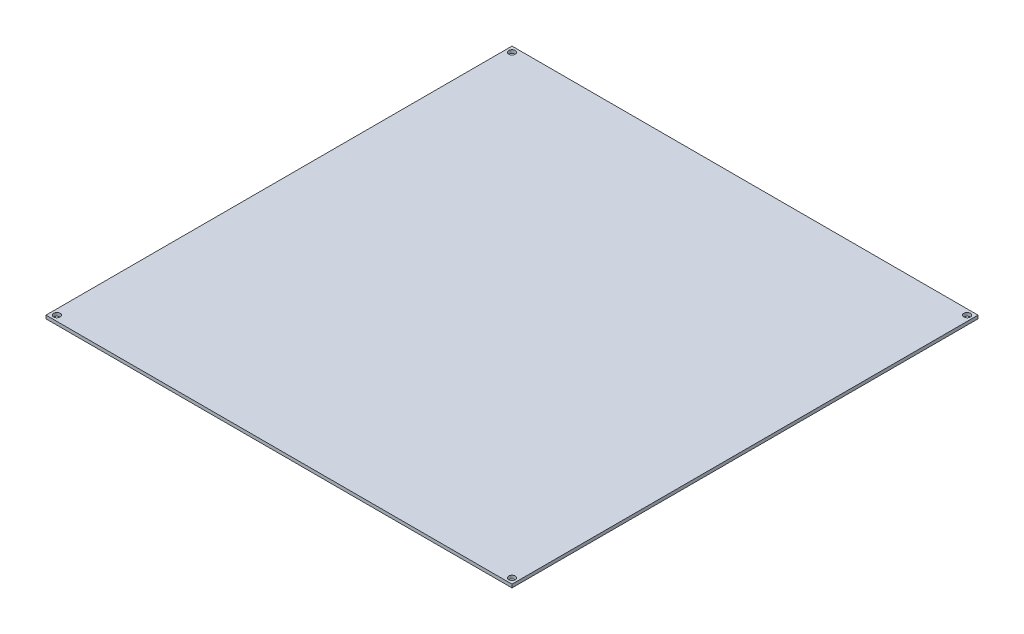
ISO-10303-21;
HEADER;
FILE_DESCRIPTION(('STEP AP214'),'2;1');
FILE_NAME('part.step','',(''),(''),'','','');
FILE_SCHEMA(('AUTOMOTIVE_DESIGN { 1 0 10303 214 1 1 1 1 }'));
ENDSEC;
DATA;
#1=APPLICATION_CONTEXT('core data for automotive mechanical design processes');
#2=APPLICATION_PROTOCOL_DEFINITION('international standard','automotive_design',2000,#1);
#3=PRODUCT_CONTEXT('',#1,'mechanical');
#4=PRODUCT('Part','Part','',(#3));
#5=PRODUCT_RELATED_PRODUCT_CATEGORY('part','',(#4));
#6=PRODUCT_DEFINITION_FORMATION('','',#4);
#7=PRODUCT_DEFINITION_CONTEXT('part definition',#1,'design');
#8=PRODUCT_DEFINITION('design','',#6,#7);
#9=PRODUCT_DEFINITION_SHAPE('','',#8);
#10=(LENGTH_UNIT() NAMED_UNIT(*) SI_UNIT(.MILLI.,.METRE.));
#11=(NAMED_UNIT(*) PLANE_ANGLE_UNIT() SI_UNIT($,.RADIAN.));
#12=(NAMED_UNIT(*) SI_UNIT($,.STERADIAN.) SOLID_ANGLE_UNIT());
#13=UNCERTAINTY_MEASURE_WITH_UNIT(LENGTH_MEASURE(1.E-05),#10,'distance_accuracy_value','');
#14=(GEOMETRIC_REPRESENTATION_CONTEXT(3) GLOBAL_UNCERTAINTY_ASSIGNED_CONTEXT((#13)) GLOBAL_UNIT_ASSIGNED_CONTEXT((#10,
#11,#12)) REPRESENTATION_CONTEXT('',''));
#15=CARTESIAN_POINT('',(0.,0.,0.));
#16=DIRECTION('',(0.,0.,1.));
#17=DIRECTION('',(1.,0.,0.));
#18=AXIS2_PLACEMENT_3D('',#15,#16,#17);
#19=CARTESIAN_POINT('',(-109.135097505646,1.5,-78.632939541794));
#20=DIRECTION('',(1.,0.,0.));
#21=DIRECTION('',(0.,0.,-1.));
#22=AXIS2_PLACEMENT_3D('',#19,#20,#21);
#23=PLANE('',#22);
#24=DIRECTION('',(0.,0.,1.));
#25=VECTOR('',#24,1.);
#26=CARTESIAN_POINT('',(-109.135097505646,0.,-78.632939541794));
#27=LINE('',#26,#25);
#28=CARTESIAN_POINT('',(-109.135097505646,0.,-78.632939541794));
#29=VERTEX_POINT('',#28);
#30=CARTESIAN_POINT('',(-109.135097505646,0.,135.367060458206));
#31=VERTEX_POINT('',#30);
#32=EDGE_CURVE('E106',#29,#31,#27,.T.);
#33=ORIENTED_EDGE('',*,*,#32,.T.);
#34=DIRECTION('',(0.,-1.,0.));
#35=VECTOR('',#34,1.);
#36=CARTESIAN_POINT('',(-109.135097505646,1.5,135.367060458206));
#37=LINE('',#36,#35);
#38=CARTESIAN_POINT('',(-109.135097505646,1.5,135.367060458206));
#39=VERTEX_POINT('',#38);
#40=EDGE_CURVE('E11',#39,#31,#37,.T.);
#41=ORIENTED_EDGE('',*,*,#40,.F.);
#42=DIRECTION('',(0.,0.,1.));
#43=VECTOR('',#42,1.);
#44=CARTESIAN_POINT('',(-109.135097505646,1.5,-78.632939541794));
#45=LINE('',#44,#43);
#46=CARTESIAN_POINT('',(-109.135097505646,1.5,-78.632939541794));
#47=VERTEX_POINT('',#46);
#48=EDGE_CURVE('E92',#47,#39,#45,.T.);
#49=ORIENTED_EDGE('',*,*,#48,.F.);
#50=DIRECTION('',(0.,-1.,0.));
#51=VECTOR('',#50,1.);
#52=CARTESIAN_POINT('',(-109.135097505646,1.5,-78.632939541794));
#53=LINE('',#52,#51);
#54=EDGE_CURVE('E102',#47,#29,#53,.T.);
#55=ORIENTED_EDGE('',*,*,#54,.T.);
#56=EDGE_LOOP('',(#33,#41,#49,#55));
#57=FACE_BOUND('',#56,.T.);
#58=ADVANCED_FACE('F39',(#57),#23,.F.);
#59=CARTESIAN_POINT('',(-109.135097505646,1.5,135.367060458206));
#60=DIRECTION('',(0.,0.,-1.));
#61=DIRECTION('',(-1.,0.,0.));
#62=AXIS2_PLACEMENT_3D('',#59,#60,#61);
#63=PLANE('',#62);
#64=DIRECTION('',(1.,0.,0.));
#65=VECTOR('',#64,1.);
#66=CARTESIAN_POINT('',(-109.135097505646,0.,135.367060458206));
#67=LINE('',#66,#65);
#68=CARTESIAN_POINT('',(104.864902494354,0.,135.367060458206));
#69=VERTEX_POINT('',#68);
#70=EDGE_CURVE('E97',#31,#69,#67,.T.);
#71=ORIENTED_EDGE('',*,*,#70,.T.);
#72=DIRECTION('',(0.,-1.,0.));
#73=VECTOR('',#72,1.);
#74=CARTESIAN_POINT('',(104.864902494354,1.5,135.367060458206));
#75=LINE('',#74,#73);
#76=CARTESIAN_POINT('',(104.864902494354,1.5,135.367060458206));
#77=VERTEX_POINT('',#76);
#78=EDGE_CURVE('E47',#77,#69,#75,.T.);
#79=ORIENTED_EDGE('',*,*,#78,.F.);
#80=DIRECTION('',(1.,0.,0.));
#81=VECTOR('',#80,1.);
#82=CARTESIAN_POINT('',(-109.135097505646,1.5,135.367060458206));
#83=LINE('',#82,#81);
#84=EDGE_CURVE('E87',#39,#77,#83,.T.);
#85=ORIENTED_EDGE('',*,*,#84,.F.);
#86=ORIENTED_EDGE('',*,*,#40,.T.);
#87=EDGE_LOOP('',(#71,#79,#85,#86));
#88=FACE_BOUND('',#87,.T.);
#89=ADVANCED_FACE('F96',(#88),#63,.F.);
#90=CARTESIAN_POINT('',(104.864902494354,1.5,-78.632939541794));
#91=DIRECTION('',(-1.,0.,0.));
#92=DIRECTION('',(0.,0.,1.));
#93=AXIS2_PLACEMENT_3D('',#90,#91,#92);
#94=PLANE('',#93);
#95=DIRECTION('',(0.,0.,-1.));
#96=VECTOR('',#95,1.);
#97=CARTESIAN_POINT('',(104.864902494354,0.,-78.632939541794));
#98=LINE('',#97,#96);
#99=CARTESIAN_POINT('',(104.864902494354,0.,-78.632939541794));
#100=VERTEX_POINT('',#99);
#101=EDGE_CURVE('E74',#69,#100,#98,.T.);
#102=ORIENTED_EDGE('',*,*,#101,.T.);
#103=DIRECTION('',(0.,-1.,0.));
#104=VECTOR('',#103,1.);
#105=CARTESIAN_POINT('',(104.864902494354,1.5,-78.632939541794));
#106=LINE('',#105,#104);
#107=CARTESIAN_POINT('',(104.864902494354,1.5,-78.632939541794));
#108=VERTEX_POINT('',#107);
#109=EDGE_CURVE('E98',#108,#100,#106,.T.);
#110=ORIENTED_EDGE('',*,*,#109,.F.);
#111=DIRECTION('',(0.,0.,-1.));
#112=VECTOR('',#111,1.);
#113=CARTESIAN_POINT('',(104.864902494354,1.5,-78.632939541794));
#114=LINE('',#113,#112);
#115=EDGE_CURVE('E90',#77,#108,#114,.T.);
#116=ORIENTED_EDGE('',*,*,#115,.F.);
#117=ORIENTED_EDGE('',*,*,#78,.T.);
#118=EDGE_LOOP('',(#102,#110,#116,#117));
#119=FACE_BOUND('',#118,.T.);
#120=ADVANCED_FACE('F99',(#119),#94,.F.);
#121=CARTESIAN_POINT('',(-109.135097505646,1.5,-78.632939541794));
#122=DIRECTION('',(0.,0.,1.));
#123=DIRECTION('',(1.,0.,0.));
#124=AXIS2_PLACEMENT_3D('',#121,#122,#123);
#125=PLANE('',#124);
#126=DIRECTION('',(-1.,0.,0.));
#127=VECTOR('',#126,1.);
#128=CARTESIAN_POINT('',(-109.135097505646,0.,-78.632939541794));
#129=LINE('',#128,#127);
#130=EDGE_CURVE('E80',#100,#29,#129,.T.);
#131=ORIENTED_EDGE('',*,*,#130,.T.);
#132=ORIENTED_EDGE('',*,*,#54,.F.);
#133=DIRECTION('',(-1.,0.,0.));
#134=VECTOR('',#133,1.);
#135=CARTESIAN_POINT('',(-109.135097505646,1.5,-78.632939541794));
#136=LINE('',#135,#134);
#137=EDGE_CURVE('E57',#108,#47,#136,.T.);
#138=ORIENTED_EDGE('',*,*,#137,.F.);
#139=ORIENTED_EDGE('',*,*,#109,.T.);
#140=EDGE_LOOP('',(#131,#132,#138,#139));
#141=FACE_BOUND('',#140,.T.);
#142=ADVANCED_FACE('F118',(#141),#125,.F.);
#143=CARTESIAN_POINT('',(0.,1.5,0.));
#144=DIRECTION('',(0.,1.,0.));
#145=DIRECTION('',(0.,0.,1.));
#146=AXIS2_PLACEMENT_3D('',#143,#144,#145);
#147=PLANE('',#146);
#148=CARTESIAN_POINT('',(-106.635097505646,1.5,132.867060458206));
#149=DIRECTION('',(0.,1.,0.));
#150=DIRECTION('',(0.,0.,1.));
#151=AXIS2_PLACEMENT_3D('',#148,#149,#150);
#152=CIRCLE('',#151,1.49999999999999);
#153=CARTESIAN_POINT('',(-106.635097505646,1.5,134.367060458206));
#154=VERTEX_POINT('',#153);
#155=EDGE_CURVE('E147',#154,#154,#152,.T.);
#156=ORIENTED_EDGE('',*,*,#155,.F.);
#157=EDGE_LOOP('',(#156));
#158=FACE_BOUND('',#157,.T.);
#159=CARTESIAN_POINT('',(-106.635097505646,1.5,-76.132939541794));
#160=DIRECTION('',(0.,1.,0.));
#161=DIRECTION('',(0.,0.,1.));
#162=AXIS2_PLACEMENT_3D('',#159,#160,#161);
#163=CIRCLE('',#162,1.49999999999999);
#164=CARTESIAN_POINT('',(-106.635097505646,1.5,-74.632939541794));
#165=VERTEX_POINT('',#164);
#166=EDGE_CURVE('E140',#165,#165,#163,.T.);
#167=ORIENTED_EDGE('',*,*,#166,.F.);
#168=EDGE_LOOP('',(#167));
#169=FACE_BOUND('',#168,.T.);
#170=CARTESIAN_POINT('',(102.364902494354,1.5,-76.132939541794));
#171=DIRECTION('',(0.,1.,0.));
#172=DIRECTION('',(0.,0.,1.));
#173=AXIS2_PLACEMENT_3D('',#170,#171,#172);
#174=CIRCLE('',#173,1.49999999999999);
#175=CARTESIAN_POINT('',(102.364902494354,1.5,-74.632939541794));
#176=VERTEX_POINT('',#175);
#177=EDGE_CURVE('E133',#176,#176,#174,.T.);
#178=ORIENTED_EDGE('',*,*,#177,.F.);
#179=EDGE_LOOP('',(#178));
#180=FACE_BOUND('',#179,.T.);
#181=CARTESIAN_POINT('',(102.364902494354,1.5,132.867060458206));
#182=DIRECTION('',(0.,1.,0.));
#183=DIRECTION('',(0.,0.,1.));
#184=AXIS2_PLACEMENT_3D('',#181,#182,#183);
#185=CIRCLE('',#184,1.49999999999999);
#186=CARTESIAN_POINT('',(102.364902494354,1.5,134.367060458206));
#187=VERTEX_POINT('',#186);
#188=EDGE_CURVE('E127',#187,#187,#185,.T.);
#189=ORIENTED_EDGE('',*,*,#188,.F.);
#190=EDGE_LOOP('',(#189));
#191=FACE_BOUND('',#190,.T.);
#192=ORIENTED_EDGE('',*,*,#48,.T.);
#193=ORIENTED_EDGE('',*,*,#84,.T.);
#194=ORIENTED_EDGE('',*,*,#115,.T.);
#195=ORIENTED_EDGE('',*,*,#137,.T.);
#196=EDGE_LOOP('',(#192,#193,#194,#195));
#197=FACE_BOUND('',#196,.T.);
#198=ADVANCED_FACE('F88',(#158,#169,#180,#191,#197),#147,.T.);
#199=CARTESIAN_POINT('',(0.,0.,0.));
#200=DIRECTION('',(0.,1.,0.));
#201=DIRECTION('',(0.,0.,1.));
#202=AXIS2_PLACEMENT_3D('',#199,#200,#201);
#203=PLANE('',#202);
#204=CARTESIAN_POINT('',(-106.635097505646,0.,132.867060458206));
#205=DIRECTION('',(0.,1.,0.));
#206=DIRECTION('',(0.,0.,1.));
#207=AXIS2_PLACEMENT_3D('',#204,#205,#206);
#208=CIRCLE('',#207,1.5);
#209=CARTESIAN_POINT('',(-106.635097505646,0.,134.367060458206));
#210=VERTEX_POINT('',#209);
#211=EDGE_CURVE('E144',#210,#210,#208,.T.);
#212=ORIENTED_EDGE('',*,*,#211,.T.);
#213=EDGE_LOOP('',(#212));
#214=FACE_BOUND('',#213,.T.);
#215=CARTESIAN_POINT('',(-106.635097505646,0.,-76.132939541794));
#216=DIRECTION('',(0.,1.,0.));
#217=DIRECTION('',(0.,0.,1.));
#218=AXIS2_PLACEMENT_3D('',#215,#216,#217);
#219=CIRCLE('',#218,1.5);
#220=CARTESIAN_POINT('',(-106.635097505646,0.,-74.632939541794));
#221=VERTEX_POINT('',#220);
#222=EDGE_CURVE('E136',#221,#221,#219,.T.);
#223=ORIENTED_EDGE('',*,*,#222,.T.);
#224=EDGE_LOOP('',(#223));
#225=FACE_BOUND('',#224,.T.);
#226=CARTESIAN_POINT('',(102.364902494354,0.,-76.132939541794));
#227=DIRECTION('',(0.,1.,0.));
#228=DIRECTION('',(0.,0.,1.));
#229=AXIS2_PLACEMENT_3D('',#226,#227,#228);
#230=CIRCLE('',#229,1.5);
#231=CARTESIAN_POINT('',(102.364902494354,0.,-74.632939541794));
#232=VERTEX_POINT('',#231);
#233=EDGE_CURVE('E130',#232,#232,#230,.T.);
#234=ORIENTED_EDGE('',*,*,#233,.T.);
#235=EDGE_LOOP('',(#234));
#236=FACE_BOUND('',#235,.T.);
#237=CARTESIAN_POINT('',(102.364902494354,0.,132.867060458206));
#238=DIRECTION('',(0.,1.,0.));
#239=DIRECTION('',(0.,0.,1.));
#240=AXIS2_PLACEMENT_3D('',#237,#238,#239);
#241=CIRCLE('',#240,1.5);
#242=CARTESIAN_POINT('',(102.364902494354,0.,134.367060458206));
#243=VERTEX_POINT('',#242);
#244=EDGE_CURVE('E110',#243,#243,#241,.T.);
#245=ORIENTED_EDGE('',*,*,#244,.T.);
#246=EDGE_LOOP('',(#245));
#247=FACE_BOUND('',#246,.T.);
#248=ORIENTED_EDGE('',*,*,#32,.F.);
#249=ORIENTED_EDGE('',*,*,#130,.F.);
#250=ORIENTED_EDGE('',*,*,#101,.F.);
#251=ORIENTED_EDGE('',*,*,#70,.F.);
#252=EDGE_LOOP('',(#248,#249,#250,#251));
#253=FACE_BOUND('',#252,.T.);
#254=ADVANCED_FACE('F121',(#214,#225,#236,#247,#253),#203,.F.);
#255=CARTESIAN_POINT('',(102.364902494354,1.5,132.867060458206));
#256=DIRECTION('',(0.,1.,0.));
#257=DIRECTION('',(0.,0.,1.));
#258=AXIS2_PLACEMENT_3D('',#255,#256,#257);
#259=CYLINDRICAL_SURFACE('',#258,1.49999999999999);
#260=ORIENTED_EDGE('',*,*,#244,.F.);
#261=EDGE_LOOP('',(#260));
#262=FACE_BOUND('',#261,.T.);
#263=ORIENTED_EDGE('',*,*,#188,.T.);
#264=EDGE_LOOP('',(#263));
#265=FACE_BOUND('',#264,.T.);
#266=ADVANCED_FACE('F162',(#262,#265),#259,.F.);
#267=CARTESIAN_POINT('',(102.364902494354,1.5,-76.132939541794));
#268=DIRECTION('',(0.,1.,0.));
#269=DIRECTION('',(0.,0.,1.));
#270=AXIS2_PLACEMENT_3D('',#267,#268,#269);
#271=CYLINDRICAL_SURFACE('',#270,1.49999999999999);
#272=ORIENTED_EDGE('',*,*,#233,.F.);
#273=EDGE_LOOP('',(#272));
#274=FACE_BOUND('',#273,.T.);
#275=ORIENTED_EDGE('',*,*,#177,.T.);
#276=EDGE_LOOP('',(#275));
#277=FACE_BOUND('',#276,.T.);
#278=ADVANCED_FACE('F164',(#274,#277),#271,.F.);
#279=CARTESIAN_POINT('',(-106.635097505646,1.5,-76.132939541794));
#280=DIRECTION('',(0.,1.,0.));
#281=DIRECTION('',(0.,0.,1.));
#282=AXIS2_PLACEMENT_3D('',#279,#280,#281);
#283=CYLINDRICAL_SURFACE('',#282,1.49999999999999);
#284=ORIENTED_EDGE('',*,*,#222,.F.);
#285=EDGE_LOOP('',(#284));
#286=FACE_BOUND('',#285,.T.);
#287=ORIENTED_EDGE('',*,*,#166,.T.);
#288=EDGE_LOOP('',(#287));
#289=FACE_BOUND('',#288,.T.);
#290=ADVANCED_FACE('F171',(#286,#289),#283,.F.);
#291=CARTESIAN_POINT('',(-106.635097505646,1.5,132.867060458206));
#292=DIRECTION('',(0.,1.,0.));
#293=DIRECTION('',(0.,0.,1.));
#294=AXIS2_PLACEMENT_3D('',#291,#292,#293);
#295=CYLINDRICAL_SURFACE('',#294,1.49999999999999);
#296=ORIENTED_EDGE('',*,*,#211,.F.);
#297=EDGE_LOOP('',(#296));
#298=FACE_BOUND('',#297,.T.);
#299=ORIENTED_EDGE('',*,*,#155,.T.);
#300=EDGE_LOOP('',(#299));
#301=FACE_BOUND('',#300,.T.);
#302=ADVANCED_FACE('F151',(#298,#301),#295,.F.);
#303=CLOSED_SHELL('',(#58,#89,#120,#142,#198,#254,#266,#278,#290,#302));
#304=MANIFOLD_SOLID_BREP('B2',#303);
#305=ADVANCED_BREP_SHAPE_REPRESENTATION('',(#18,#304),#14);
#306=SHAPE_DEFINITION_REPRESENTATION(#9,#305);
ENDSEC;
END-ISO-10303-21;
